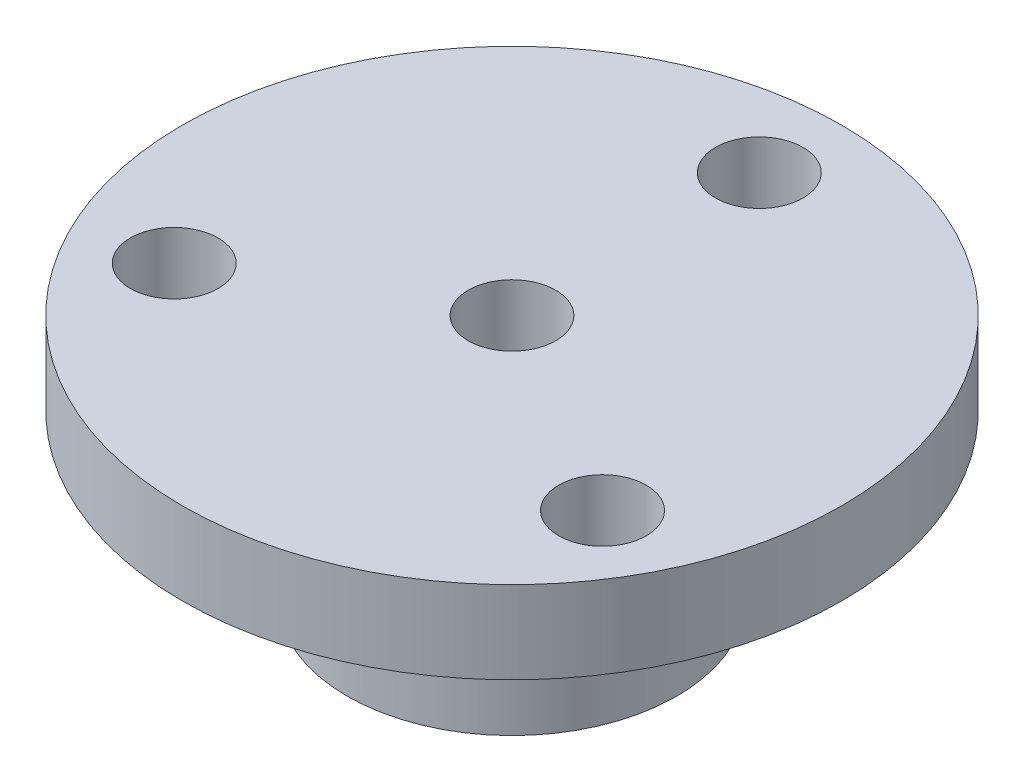
ISO-10303-21;
HEADER;
FILE_DESCRIPTION(('STEP AP214'),'2;1');
FILE_NAME('part.step','',(''),(''),'','','');
FILE_SCHEMA(('AUTOMOTIVE_DESIGN { 1 0 10303 214 1 1 1 1 }'));
ENDSEC;
DATA;
#1=APPLICATION_CONTEXT('core data for automotive mechanical design processes');
#2=APPLICATION_PROTOCOL_DEFINITION('international standard','automotive_design',2000,#1);
#3=PRODUCT_CONTEXT('',#1,'mechanical');
#4=PRODUCT('Part','Part','',(#3));
#5=PRODUCT_RELATED_PRODUCT_CATEGORY('part','',(#4));
#6=PRODUCT_DEFINITION_FORMATION('','',#4);
#7=PRODUCT_DEFINITION_CONTEXT('part definition',#1,'design');
#8=PRODUCT_DEFINITION('design','',#6,#7);
#9=PRODUCT_DEFINITION_SHAPE('','',#8);
#10=(LENGTH_UNIT() NAMED_UNIT(*) SI_UNIT(.MILLI.,.METRE.));
#11=(NAMED_UNIT(*) PLANE_ANGLE_UNIT() SI_UNIT($,.RADIAN.));
#12=(NAMED_UNIT(*) SI_UNIT($,.STERADIAN.) SOLID_ANGLE_UNIT());
#13=UNCERTAINTY_MEASURE_WITH_UNIT(LENGTH_MEASURE(1.E-05),#10,'distance_accuracy_value','');
#14=(GEOMETRIC_REPRESENTATION_CONTEXT(3) GLOBAL_UNCERTAINTY_ASSIGNED_CONTEXT((#13)) GLOBAL_UNIT_ASSIGNED_CONTEXT((#10,
#11,#12)) REPRESENTATION_CONTEXT('',''));
#15=CARTESIAN_POINT('',(0.,0.,0.));
#16=DIRECTION('',(0.,0.,1.));
#17=DIRECTION('',(1.,0.,0.));
#18=AXIS2_PLACEMENT_3D('',#15,#16,#17);
#19=CARTESIAN_POINT('',(0.,12.7,0.));
#20=DIRECTION('',(0.,-1.,0.));
#21=DIRECTION('',(0.,0.,-1.));
#22=AXIS2_PLACEMENT_3D('',#19,#20,#21);
#23=CYLINDRICAL_SURFACE('',#22,12.7);
#24=CARTESIAN_POINT('',(-2.45745,6.35,12.4599734950561));
#25=CARTESIAN_POINT('',(-2.4574448457959,6.48664242672499,12.4599761778988));
#26=CARTESIAN_POINT('',(-2.446014651362,6.6233507914143,12.4622456537329));
#27=CARTESIAN_POINT('',(-2.40063013384237,6.89290675159974,12.4710660856373));
#28=CARTESIAN_POINT('',(-2.36665721610313,7.0257510652777,12.4776205761908));
#29=CARTESIAN_POINT('',(-2.27727460436938,7.28363990049863,12.4942415344762));
#30=CARTESIAN_POINT('',(-2.22188551723814,7.40869178609644,12.5043046252844));
#31=CARTESIAN_POINT('',(-2.09129832369802,7.64772226148924,12.5268049218276));
#32=CARTESIAN_POINT('',(-2.01610155444819,7.76170159804916,12.5392419672883));
#33=CARTESIAN_POINT('',(-1.84697184812669,7.97686853830274,12.5652728543158));
#34=CARTESIAN_POINT('',(-1.75282701136112,8.07788815667578,12.5788786796091));
#35=CARTESIAN_POINT('',(-1.54893149930474,8.26280308915373,12.6056084254236));
#36=CARTESIAN_POINT('',(-1.43917976796169,8.34669724351488,12.6187323132584));
#37=CARTESIAN_POINT('',(-1.20607824513626,8.49562737626859,12.6431482698532));
#38=CARTESIAN_POINT('',(-1.08262508783677,8.56050437641428,12.6544245667306));
#39=CARTESIAN_POINT('',(-0.82631631226013,8.66853357239807,12.6737404425825));
#40=CARTESIAN_POINT('',(-0.693461518627308,8.71168767092656,12.6817803050213));
#41=CARTESIAN_POINT('',(-0.423862742022591,8.7745249727266,12.6936327851509));
#42=CARTESIAN_POINT('',(-0.287187096527185,8.79449159280585,12.6974964070093));
#43=CARTESIAN_POINT('',(-0.0123749641642468,8.81127079263568,12.7007370467831));
#44=CARTESIAN_POINT('',(0.125761389442495,8.80808546665416,12.7001144705089));
#45=CARTESIAN_POINT('',(0.397628285392874,8.77886742173493,12.69449256087));
#46=CARTESIAN_POINT('',(0.531393015116728,8.75313992652011,12.6895516998391));
#47=CARTESIAN_POINT('',(0.792670176599979,8.68005124588424,12.6759141280809));
#48=CARTESIAN_POINT('',(0.920182369552153,8.63268923487354,12.6672172740227));
#49=CARTESIAN_POINT('',(1.16621328724908,8.51738894916172,12.6469478098291));
#50=CARTESIAN_POINT('',(1.28467392907244,8.44932981288714,12.6353583816616));
#51=CARTESIAN_POINT('',(1.508606768977,8.29465645722117,12.6105835288909));
#52=CARTESIAN_POINT('',(1.61407756193908,8.20804023327068,12.5973979319346));
#53=CARTESIAN_POINT('',(1.81084660401586,8.01703300392843,12.5706353175682));
#54=CARTESIAN_POINT('',(1.90188539160334,7.91237492065857,12.5570554242244));
#55=CARTESIAN_POINT('',(2.06515946058258,7.68914143303397,12.5312397580398));
#56=CARTESIAN_POINT('',(2.13739443021129,7.57056579797665,12.5190040074865));
#57=CARTESIAN_POINT('',(2.26109165029383,7.32250562521867,12.4972571098091));
#58=CARTESIAN_POINT('',(2.31251416832229,7.1930007869265,12.4877511840622));
#59=CARTESIAN_POINT('',(2.39279595460755,6.92696352894975,12.4726185385136));
#60=CARTESIAN_POINT('',(2.42165795975938,6.79043196384462,12.4669913481788));
#61=CARTESIAN_POINT('',(2.45561638425017,6.51656219919693,12.460346956076));
#62=CARTESIAN_POINT('',(2.46108647558824,6.37927204189445,12.4592572777104));
#63=CARTESIAN_POINT('',(2.44910928480689,6.10574050548308,12.4616170579326));
#64=CARTESIAN_POINT('',(2.43166321414412,5.96949907131671,12.465066276573));
#65=CARTESIAN_POINT('',(2.37467036331905,5.70317383256491,12.4760475287435));
#66=CARTESIAN_POINT('',(2.33532125225701,5.57304608494399,12.483543027661));
#67=CARTESIAN_POINT('',(2.23584979748039,5.32123044657609,12.5017405459737));
#68=CARTESIAN_POINT('',(2.17572583680595,5.19954321366151,12.5124428149513));
#69=CARTESIAN_POINT('',(2.0355580499034,4.96642190363086,12.5360119939555));
#70=CARTESIAN_POINT('',(1.95527922707509,4.85513168879348,12.5489038148873));
#71=CARTESIAN_POINT('',(1.77739569825356,4.64746625446288,12.5753302611157));
#72=CARTESIAN_POINT('',(1.67978932831431,4.55109246904381,12.5888649480545));
#73=CARTESIAN_POINT('',(1.46834840823623,4.37458977357421,12.6152861078184));
#74=CARTESIAN_POINT('',(1.35430179847242,4.29471281074465,12.6281605468502));
#75=CARTESIAN_POINT('',(1.11419082006876,4.15525351851469,12.6516049623348));
#76=CARTESIAN_POINT('',(0.988126934855061,4.09567037318331,12.6621750314306));
#77=CARTESIAN_POINT('',(0.728240024572953,3.99886254115331,12.6797681683655));
#78=CARTESIAN_POINT('',(0.594463522735846,3.96151660338894,12.6868104379185));
#79=CARTESIAN_POINT('',(0.322387108479282,3.9098576157996,12.6966366275396));
#80=CARTESIAN_POINT('',(0.184087706221978,3.89554197734403,12.6994210261954));
#81=CARTESIAN_POINT('',(-0.0906971128940913,3.89044487497494,12.7004073808728));
#82=CARTESIAN_POINT('',(-0.227175364984209,3.89928371061225,12.698683270852));
#83=CARTESIAN_POINT('',(-0.496662826917979,3.93940985161233,12.6910008207745));
#84=CARTESIAN_POINT('',(-0.629672074771883,3.97069691090033,12.6850425271323));
#85=CARTESIAN_POINT('',(-0.888228202425111,4.05466718662815,12.6695621582855));
#86=CARTESIAN_POINT('',(-1.01378946448916,4.10730751800716,12.6600472290758));
#87=CARTESIAN_POINT('',(-1.25435295894836,4.23244341140539,12.6384809881019));
#88=CARTESIAN_POINT('',(-1.36935442229324,4.30494041801995,12.6264294918143));
#89=CARTESIAN_POINT('',(-1.58741907756561,4.46902637985321,12.6008869275532));
#90=CARTESIAN_POINT('',(-1.69027458438788,4.56088840368228,12.5873767865754));
#91=CARTESIAN_POINT('',(-1.8792417370891,4.76053271735398,12.5605565925732));
#92=CARTESIAN_POINT('',(-1.96534942772726,4.86831875733518,12.5472465874971));
#93=CARTESIAN_POINT('',(-2.11918691981705,5.09803774462214,12.5221882641966));
#94=CARTESIAN_POINT('',(-2.18672511647075,5.22010091392463,12.5104568224747));
#95=CARTESIAN_POINT('',(-2.30022710547816,5.47403223595291,12.4900883656506));
#96=CARTESIAN_POINT('',(-2.34621088906287,5.6058911712775,12.4814484849628));
#97=CARTESIAN_POINT('',(-2.40615510024334,5.84008101079934,12.4700067297984));
#98=CARTESIAN_POINT('',(-2.42535704026861,5.94105712398996,12.4662670679425));
#99=CARTESIAN_POINT('',(-2.45100623216742,6.14467644742993,12.4612494801056));
#100=CARTESIAN_POINT('',(-2.45745387314332,6.24731960672548,12.4599714790252));
#101=CARTESIAN_POINT('',(-2.45745,6.35,12.4599734950561));
#102=B_SPLINE_CURVE_WITH_KNOTS('',3,(#24,#25,#26,#27,#28,#29,#30,#31,#32,#33,#34,#35,#36,#37,
#38,#39,#40,#41,#42,#43,#44,#45,#46,#47,#48,#49,#50,#51,#52,#53,#54,#55,#56,#57,#58,#59,#60,#61,
#62,#63,#64,#65,#66,#67,#68,#69,#70,#71,#72,#73,#74,#75,#76,#77,#78,#79,#80,#81,#82,#83,#84,#85,
#86,#87,#88,#89,#90,#91,#92,#93,#94,#95,#96,#97,#98,#99,#100,#101),.UNSPECIFIED.,.T.,.F.,(4,2,2,
2,2,2,2,2,2,2,2,2,2,2,2,2,2,2,2,2,2,2,2,2,2,2,2,2,2,2,2,2,2,2,2,2,2,2,4),(0.,0.409551426062621,
0.819441096504625,1.22893734437489,1.63840595542539,2.05273728694917,2.46709666786626,
2.88482717007892,3.30252107726459,3.71505398101899,4.12754956852948,4.53454475553279,
4.94155547508066,5.35099013618775,5.76046904724236,6.1766323804962,6.59280261320481,
7.00976363837795,7.4266740726914,7.83689913161727,8.24710250497998,8.65366255669201,
9.0602542591468,9.47182672315997,9.88343873144225,10.3009354489507,10.7184153786502,
11.1335975926482,11.5487331364541,11.9571038258666,12.3654700388363,12.7730201342035,
13.1805998871754,13.5943656991633,14.0082291096411,14.4262149910528,14.8438124291629,
15.1515805615941,15.4593393046299),.UNSPECIFIED.);
#103=CARTESIAN_POINT('',(-2.45745,6.35,12.4599734950561));
#104=VERTEX_POINT('',#103);
#105=EDGE_CURVE('E79',#104,#104,#102,.T.);
#106=ORIENTED_EDGE('',*,*,#105,.T.);
#107=EDGE_LOOP('',(#106));
#108=FACE_BOUND('',#107,.T.);
#109=CARTESIAN_POINT('',(0.,12.7,0.));
#110=DIRECTION('',(0.,1.,0.));
#111=DIRECTION('',(0.,0.,1.));
#112=AXIS2_PLACEMENT_3D('',#109,#110,#111);
#113=CIRCLE('',#112,12.7);
#114=CARTESIAN_POINT('',(0.,12.7,12.7));
#115=VERTEX_POINT('',#114);
#116=EDGE_CURVE('E10',#115,#115,#113,.T.);
#117=ORIENTED_EDGE('',*,*,#116,.F.);
#118=EDGE_LOOP('',(#117));
#119=FACE_BOUND('',#118,.T.);
#120=CARTESIAN_POINT('',(0.,0.,0.));
#121=DIRECTION('',(0.,1.,0.));
#122=DIRECTION('',(0.,0.,1.));
#123=AXIS2_PLACEMENT_3D('',#120,#121,#122);
#124=CIRCLE('',#123,12.7);
#125=CARTESIAN_POINT('',(0.,0.,12.7));
#126=VERTEX_POINT('',#125);
#127=EDGE_CURVE('E43',#126,#126,#124,.T.);
#128=ORIENTED_EDGE('',*,*,#127,.T.);
#129=EDGE_LOOP('',(#128));
#130=FACE_BOUND('',#129,.T.);
#131=ADVANCED_FACE('F31',(#108,#119,#130),#23,.T.);
#132=CARTESIAN_POINT('',(0.,0.,0.));
#133=DIRECTION('',(0.,1.,0.));
#134=DIRECTION('',(0.,0.,1.));
#135=AXIS2_PLACEMENT_3D('',#132,#133,#134);
#136=PLANE('',#135);
#137=CARTESIAN_POINT('',(0.,0.,0.));
#138=DIRECTION('',(0.,1.,0.));
#139=DIRECTION('',(0.,0.,1.));
#140=AXIS2_PLACEMENT_3D('',#137,#138,#139);
#141=CIRCLE('',#140,3.3734375);
#142=CARTESIAN_POINT('',(0.,0.,3.3734375));
#143=VERTEX_POINT('',#142);
#144=EDGE_CURVE('E53',#143,#143,#141,.T.);
#145=ORIENTED_EDGE('',*,*,#144,.T.);
#146=EDGE_LOOP('',(#145));
#147=FACE_BOUND('',#146,.T.);
#148=ORIENTED_EDGE('',*,*,#127,.F.);
#149=EDGE_LOOP('',(#148));
#150=FACE_BOUND('',#149,.T.);
#151=ADVANCED_FACE('F113',(#147,#150),#136,.F.);
#152=CARTESIAN_POINT('',(0.,12.7,0.));
#153=DIRECTION('',(0.,1.,0.));
#154=DIRECTION('',(0.,0.,1.));
#155=AXIS2_PLACEMENT_3D('',#152,#153,#154);
#156=PLANE('',#155);
#157=CARTESIAN_POINT('',(0.,12.7,-19.05));
#158=DIRECTION('',(0.,1.,0.));
#159=DIRECTION('',(0.,0.,1.));
#160=AXIS2_PLACEMENT_3D('',#157,#158,#159);
#161=CIRCLE('',#160,3.3782);
#162=CARTESIAN_POINT('',(0.,12.7,-15.6718));
#163=VERTEX_POINT('',#162);
#164=EDGE_CURVE('E73',#163,#163,#161,.T.);
#165=ORIENTED_EDGE('',*,*,#164,.T.);
#166=EDGE_LOOP('',(#165));
#167=FACE_BOUND('',#166,.T.);
#168=CARTESIAN_POINT('',(-16.4977839420935,12.7,9.52500000000008));
#169=DIRECTION('',(0.,1.,0.));
#170=DIRECTION('',(0.,0.,1.));
#171=AXIS2_PLACEMENT_3D('',#168,#169,#170);
#172=CIRCLE('',#171,3.3782);
#173=CARTESIAN_POINT('',(-16.4977839420935,12.7,12.9032000000001));
#174=VERTEX_POINT('',#173);
#175=EDGE_CURVE('E67',#174,#174,#172,.T.);
#176=ORIENTED_EDGE('',*,*,#175,.T.);
#177=EDGE_LOOP('',(#176));
#178=FACE_BOUND('',#177,.T.);
#179=CARTESIAN_POINT('',(16.4977839420935,12.7,9.52500000000008));
#180=DIRECTION('',(0.,1.,0.));
#181=DIRECTION('',(0.,0.,1.));
#182=AXIS2_PLACEMENT_3D('',#179,#180,#181);
#183=CIRCLE('',#182,3.3782);
#184=CARTESIAN_POINT('',(16.4977839420935,12.7,12.9032000000001));
#185=VERTEX_POINT('',#184);
#186=EDGE_CURVE('E59',#185,#185,#183,.T.);
#187=ORIENTED_EDGE('',*,*,#186,.T.);
#188=EDGE_LOOP('',(#187));
#189=FACE_BOUND('',#188,.T.);
#190=CARTESIAN_POINT('',(0.,12.7,0.));
#191=DIRECTION('',(0.,1.,0.));
#192=DIRECTION('',(0.,0.,1.));
#193=AXIS2_PLACEMENT_3D('',#190,#191,#192);
#194=CIRCLE('',#193,25.4);
#195=CARTESIAN_POINT('',(0.,12.7,25.4));
#196=VERTEX_POINT('',#195);
#197=EDGE_CURVE('E50',#196,#196,#194,.T.);
#198=ORIENTED_EDGE('',*,*,#197,.F.);
#199=EDGE_LOOP('',(#198));
#200=FACE_BOUND('',#199,.T.);
#201=ORIENTED_EDGE('',*,*,#116,.T.);
#202=EDGE_LOOP('',(#201));
#203=FACE_BOUND('',#202,.T.);
#204=ADVANCED_FACE('F110',(#167,#178,#189,#200,#203),#156,.F.);
#205=CARTESIAN_POINT('',(0.,19.05,0.));
#206=DIRECTION('',(0.,-1.,0.));
#207=DIRECTION('',(0.,0.,-1.));
#208=AXIS2_PLACEMENT_3D('',#205,#206,#207);
#209=CYLINDRICAL_SURFACE('',#208,25.4);
#210=CARTESIAN_POINT('',(0.,19.05,0.));
#211=DIRECTION('',(0.,1.,0.));
#212=DIRECTION('',(0.,0.,1.));
#213=AXIS2_PLACEMENT_3D('',#210,#211,#212);
#214=CIRCLE('',#213,25.4);
#215=CARTESIAN_POINT('',(0.,19.05,25.4));
#216=VERTEX_POINT('',#215);
#217=EDGE_CURVE('E48',#216,#216,#214,.T.);
#218=ORIENTED_EDGE('',*,*,#217,.F.);
#219=EDGE_LOOP('',(#218));
#220=FACE_BOUND('',#219,.T.);
#221=ORIENTED_EDGE('',*,*,#197,.T.);
#222=EDGE_LOOP('',(#221));
#223=FACE_BOUND('',#222,.T.);
#224=ADVANCED_FACE('F108',(#220,#223),#209,.T.);
#225=CARTESIAN_POINT('',(0.,19.05,0.));
#226=DIRECTION('',(0.,1.,0.));
#227=DIRECTION('',(0.,0.,1.));
#228=AXIS2_PLACEMENT_3D('',#225,#226,#227);
#229=PLANE('',#228);
#230=CARTESIAN_POINT('',(0.,19.05,-19.05));
#231=DIRECTION('',(0.,1.,0.));
#232=DIRECTION('',(0.,0.,1.));
#233=AXIS2_PLACEMENT_3D('',#230,#231,#232);
#234=CIRCLE('',#233,3.3782);
#235=CARTESIAN_POINT('',(0.,19.05,-15.6718));
#236=VERTEX_POINT('',#235);
#237=EDGE_CURVE('E76',#236,#236,#234,.T.);
#238=ORIENTED_EDGE('',*,*,#237,.F.);
#239=EDGE_LOOP('',(#238));
#240=FACE_BOUND('',#239,.T.);
#241=CARTESIAN_POINT('',(-16.4977839420935,19.05,9.52500000000008));
#242=DIRECTION('',(0.,1.,0.));
#243=DIRECTION('',(0.,0.,1.));
#244=AXIS2_PLACEMENT_3D('',#241,#242,#243);
#245=CIRCLE('',#244,3.3782);
#246=CARTESIAN_POINT('',(-16.4977839420935,19.05,12.9032000000001));
#247=VERTEX_POINT('',#246);
#248=EDGE_CURVE('E70',#247,#247,#245,.T.);
#249=ORIENTED_EDGE('',*,*,#248,.F.);
#250=EDGE_LOOP('',(#249));
#251=FACE_BOUND('',#250,.T.);
#252=CARTESIAN_POINT('',(16.4977839420935,19.05,9.52500000000008));
#253=DIRECTION('',(0.,1.,0.));
#254=DIRECTION('',(0.,0.,1.));
#255=AXIS2_PLACEMENT_3D('',#252,#253,#254);
#256=CIRCLE('',#255,3.3782);
#257=CARTESIAN_POINT('',(16.4977839420935,19.05,12.9032000000001));
#258=VERTEX_POINT('',#257);
#259=EDGE_CURVE('E64',#258,#258,#256,.T.);
#260=ORIENTED_EDGE('',*,*,#259,.F.);
#261=EDGE_LOOP('',(#260));
#262=FACE_BOUND('',#261,.T.);
#263=CARTESIAN_POINT('',(0.,19.05,0.));
#264=DIRECTION('',(0.,1.,0.));
#265=DIRECTION('',(0.,0.,1.));
#266=AXIS2_PLACEMENT_3D('',#263,#264,#265);
#267=CIRCLE('',#266,3.3734375);
#268=CARTESIAN_POINT('',(0.,19.05,3.3734375));
#269=VERTEX_POINT('',#268);
#270=EDGE_CURVE('E56',#269,#269,#267,.T.);
#271=ORIENTED_EDGE('',*,*,#270,.F.);
#272=EDGE_LOOP('',(#271));
#273=FACE_BOUND('',#272,.T.);
#274=ORIENTED_EDGE('',*,*,#217,.T.);
#275=EDGE_LOOP('',(#274));
#276=FACE_BOUND('',#275,.T.);
#277=ADVANCED_FACE('F104',(#240,#251,#262,#273,#276),#229,.T.);
#278=CARTESIAN_POINT('',(0.,0.,0.));
#279=DIRECTION('',(0.,1.,0.));
#280=DIRECTION('',(0.,0.,1.));
#281=AXIS2_PLACEMENT_3D('',#278,#279,#280);
#282=CYLINDRICAL_SURFACE('',#281,3.3734375);
#283=CARTESIAN_POINT('',(0.,3.89255,3.3734375));
#284=CARTESIAN_POINT('',(0.120809819258964,3.89255742435154,3.37343042836875));
#285=CARTESIAN_POINT('',(0.241823751778381,3.90153039226537,3.36687840714502));
#286=CARTESIAN_POINT('',(0.480076168684002,3.93687492647653,3.34126463938644));
#287=CARTESIAN_POINT('',(0.59730409438668,3.96329137076398,3.32217062590315));
#288=CARTESIAN_POINT('',(0.823900726131385,4.03177299389469,3.27332022419693));
#289=CARTESIAN_POINT('',(0.933311705404955,4.07374496374914,3.243627382656));
#290=CARTESIAN_POINT('',(1.14286956932636,4.17140225381821,3.17585807719619));
#291=CARTESIAN_POINT('',(1.2430193961436,4.22708319810663,3.13778428889871));
#292=CARTESIAN_POINT('',(1.44160894933497,4.35598587734537,3.05197992264272));
#293=CARTESIAN_POINT('',(1.53906314289097,4.43034294312858,3.00368578752956));
#294=CARTESIAN_POINT('',(1.72097540486943,4.59156098084748,2.90329914556908));
#295=CARTESIAN_POINT('',(1.8054125372389,4.67844166983441,2.85120071432524));
#296=CARTESIAN_POINT('',(1.97552827081189,4.88129143958565,2.7367434454912));
#297=CARTESIAN_POINT('',(2.05834425481899,4.99964431632546,2.67433150998881));
#298=CARTESIAN_POINT('',(2.20310389845215,5.2516209472937,2.55638373579672));
#299=CARTESIAN_POINT('',(2.26507931146999,5.38522105047451,2.50083751869401));
#300=CARTESIAN_POINT('',(2.34867743786964,5.62009874895566,2.42197241020342));
#301=CARTESIAN_POINT('',(2.37686726595916,5.71747859341286,2.39406868833275));
#302=CARTESIAN_POINT('',(2.42120825745763,5.91729211522708,2.3492206216884));
#303=CARTESIAN_POINT('',(2.43738610972717,6.01971404618924,2.33225199188832));
#304=CARTESIAN_POINT('',(2.45665652740064,6.22797089407639,2.31195615411444));
#305=CARTESIAN_POINT('',(2.45965193410343,6.33382537879628,2.30873023975054));
#306=CARTESIAN_POINT('',(2.45201170727871,6.54450664502808,2.31683810619761));
#307=CARTESIAN_POINT('',(2.44136617778752,6.64933262478575,2.32818245717799));
#308=CARTESIAN_POINT('',(2.40539238388608,6.86633789586512,2.36535099034132));
#309=CARTESIAN_POINT('',(2.37852799253085,6.97799227580827,2.39267906751035));
#310=CARTESIAN_POINT('',(2.31085757692996,7.19370920327882,2.45809253832808));
#311=CARTESIAN_POINT('',(2.27001920124956,7.29775344788235,2.49620285837556));
#312=CARTESIAN_POINT('',(2.15997991117618,7.53127489883722,2.59259499255298));
#313=CARTESIAN_POINT('',(2.08585712860835,7.65740651728297,2.65333394740023));
#314=CARTESIAN_POINT('',(1.91741996088834,7.89391152611339,2.77751266262892));
#315=CARTESIAN_POINT('',(1.82308338987352,8.0042673779536,2.8409553287061));
#316=CARTESIAN_POINT('',(1.61386339061077,8.20908457492367,2.96487982935868));
#317=CARTESIAN_POINT('',(1.49873189377957,8.30332384756018,3.02531323803714));
#318=CARTESIAN_POINT('',(1.2501010043613,8.47100556712444,3.13619959331142));
#319=CARTESIAN_POINT('',(1.11664480211936,8.54449570929199,3.18667534730893));
#320=CARTESIAN_POINT('',(0.870452633779477,8.65097219295202,3.26105100028312));
#321=CARTESIAN_POINT('',(0.761168274310344,8.68951184626901,3.2884464876608));
#322=CARTESIAN_POINT('',(0.536229381377058,8.75105788526638,3.33251127123385));
#323=CARTESIAN_POINT('',(0.420579614120613,8.77407572653578,3.34918847743271));
#324=CARTESIAN_POINT('',(0.185609145455707,8.80329829541414,3.3703991287777));
#325=CARTESIAN_POINT('',(0.0662764871670874,8.80944075460467,3.37488759804019));
#326=CARTESIAN_POINT('',(-0.171819100272039,8.80432590313485,3.37116184013932));
#327=CARTESIAN_POINT('',(-0.290582008334039,8.79306795333159,3.36294714636988));
#328=CARTESIAN_POINT('',(-0.517113239967224,8.75501555990001,3.33541032803371));
#329=CARTESIAN_POINT('',(-0.62512205300109,8.72914551505946,3.31674962163702));
#330=CARTESIAN_POINT('',(-0.834862473708972,8.66390117087595,3.27026544229479));
#331=CARTESIAN_POINT('',(-0.936592770366474,8.62452406230548,3.24244006330935));
#332=CARTESIAN_POINT('',(-1.14018387268981,8.53006026017112,3.17685848727746));
#333=CARTESIAN_POINT('',(-1.24135881494024,8.47394320348737,3.1384710324186));
#334=CARTESIAN_POINT('',(-1.43318370686475,8.34953401038299,3.05565074471029));
#335=CARTESIAN_POINT('',(-1.52382666644383,8.28123386339009,3.01121393889836));
#336=CARTESIAN_POINT('',(-1.7095035808293,8.12042051083891,2.91045871988082));
#337=CARTESIAN_POINT('',(-1.80230789273614,8.02576355563223,2.85345375959012));
#338=CARTESIAN_POINT('',(-1.9716252860586,7.82283460895605,2.73919772419974));
#339=CARTESIAN_POINT('',(-2.04812484666876,7.71455143528688,2.68194648469375));
#340=CARTESIAN_POINT('',(-2.17575826039905,7.49847364398689,2.57915956803625));
#341=CARTESIAN_POINT('',(-2.22881053952334,7.39209699577444,2.53303640218665));
#342=CARTESIAN_POINT('',(-2.31979398625661,7.16974056881281,2.44998668603787));
#343=CARTESIAN_POINT('',(-2.35775672118173,7.05378145742609,2.41304099788241));
#344=CARTESIAN_POINT('',(-2.4100312007196,6.84002409031786,2.36069901009099));
#345=CARTESIAN_POINT('',(-2.42769660056338,6.7437862102143,2.34235931003165));
#346=CARTESIAN_POINT('',(-2.45139331594573,6.54843307641532,2.3175552602526));
#347=CARTESIAN_POINT('',(-2.45744161335363,6.44932223803325,2.31107357715495));
#348=CARTESIAN_POINT('',(-2.45745838239333,6.25093577656586,2.31105583450143));
#349=CARTESIAN_POINT('',(-2.45140712717078,6.15166014847978,2.31754091568308));
#350=CARTESIAN_POINT('',(-2.4276654549533,5.95597776084592,2.34239180376532));
#351=CARTESIAN_POINT('',(-2.40995666748357,5.85957578076592,2.36077636163998));
#352=CARTESIAN_POINT('',(-2.35703276927338,5.64338303591173,2.41376237084077));
#353=CARTESIAN_POINT('',(-2.31815018099888,5.52529908096957,2.45158133370512));
#354=CARTESIAN_POINT('',(-2.22480999245752,5.29913298315097,2.5365881798439));
#355=CARTESIAN_POINT('',(-2.17032609061252,5.19106814179411,2.5837918429474));
#356=CARTESIAN_POINT('',(-2.04544902866081,4.98237419994712,2.68380417276703));
#357=CARTESIAN_POINT('',(-1.97463350005943,4.88205899792132,2.73673721023781));
#358=CARTESIAN_POINT('',(-1.8189352559868,4.6930285037471,2.84261386197605));
#359=CARTESIAN_POINT('',(-1.73404664892339,4.60431809780778,2.89555747135838));
#360=CARTESIAN_POINT('',(-1.53020026351651,4.42122159307609,3.00914666991995));
#361=CARTESIAN_POINT('',(-1.40786162580257,4.32993668420893,3.06889789258127));
#362=CARTESIAN_POINT('',(-1.21059162452045,4.210033249415,3.14954348735062));
#363=CARTESIAN_POINT('',(-1.14253508451073,4.17290039203407,3.17493020740931));
#364=CARTESIAN_POINT('',(-1.00218518355411,4.10483582270997,3.22198289550099));
#365=CARTESIAN_POINT('',(-0.929894049087881,4.07390088915728,3.2436507956896));
#366=CARTESIAN_POINT('',(-0.749692614693299,4.00696740173168,3.29090231203451));
#367=CARTESIAN_POINT('',(-0.639820997689785,3.97450185755068,3.31416978450867));
#368=CARTESIAN_POINT('',(-0.415140670052222,3.92515459099675,3.34971635600582));
#369=CARTESIAN_POINT('',(-0.300347822973564,3.90822623496866,3.36202833367388));
#370=CARTESIAN_POINT('',(-0.154058810248004,3.89718894646974,3.37005963799728));
#371=CARTESIAN_POINT('',(-0.123292125837088,3.89545138156316,3.37132440222078));
#372=CARTESIAN_POINT('',(-0.0616880716105748,3.89313086622181,3.37301430460906));
#373=CARTESIAN_POINT('',(-0.0308506910886242,3.89254810407485,3.37343930585248));
#374=CARTESIAN_POINT('',(0.,3.89255,3.3734375));
#375=B_SPLINE_CURVE_WITH_KNOTS('',3,(#283,#284,#285,#286,#287,#288,#289,#290,#291,#292,#293,
#294,#295,#296,#297,#298,#299,#300,#301,#302,#303,#304,#305,#306,#307,#308,#309,#310,#311,#312,
#313,#314,#315,#316,#317,#318,#319,#320,#321,#322,#323,#324,#325,#326,#327,#328,#329,#330,#331,
#332,#333,#334,#335,#336,#337,#338,#339,#340,#341,#342,#343,#344,#345,#346,#347,#348,#349,#350,
#351,#352,#353,#354,#355,#356,#357,#358,#359,#360,#361,#362,#363,#364,#365,#366,#367,#368,#369,
#370,#371,#372,#373,#374),.UNSPECIFIED.,.T.,.F.,(4,2,2,2,2,2,2,2,2,2,2,2,2,2,2,2,2,2,2,2,2,2,2,
2,2,2,2,2,2,2,2,2,2,2,2,2,2,2,2,2,2,2,2,2,2,4),(0.,0.362294815515208,0.725525381688672,
1.08661375464555,1.44758701671936,1.84141921782735,2.23587837693966,2.70592539578187,
3.17525295545699,3.48957539143992,3.80319734158847,4.11912695238352,4.43528588752125,
4.78750356742649,5.140542252921,5.61334313295488,6.08666562339284,6.56606034639864,
7.04434396059499,7.40008856129506,7.75557032301653,8.11236202519496,8.46916683317458,
8.80558622054163,9.142075619587,9.50641069410823,9.87098621364781,10.302249318479,
10.7338686710483,11.1151130425766,11.4955555996616,11.7929607692989,12.089930860479,
12.3873855201954,12.6853100483432,13.0730191158299,13.4613856927123,13.8612231582274,
14.2612284374631,14.7499065157095,14.9942859868412,15.2385381008903,15.5877108012319,
15.9358320267533,16.0283346359081,16.1208523261507),.UNSPECIFIED.);
#376=CARTESIAN_POINT('',(0.,3.89255,3.3734375));
#377=VERTEX_POINT('',#376);
#378=EDGE_CURVE('E35',#377,#377,#375,.T.);
#379=ORIENTED_EDGE('',*,*,#378,.T.);
#380=EDGE_LOOP('',(#379));
#381=FACE_BOUND('',#380,.T.);
#382=ORIENTED_EDGE('',*,*,#144,.F.);
#383=EDGE_LOOP('',(#382));
#384=FACE_BOUND('',#383,.T.);
#385=ORIENTED_EDGE('',*,*,#270,.T.);
#386=EDGE_LOOP('',(#385));
#387=FACE_BOUND('',#386,.T.);
#388=ADVANCED_FACE('F99',(#381,#384,#387),#282,.F.);
#389=CARTESIAN_POINT('',(16.4977839420935,19.05,9.52500000000008));
#390=DIRECTION('',(0.,1.,0.));
#391=DIRECTION('',(0.,0.,1.));
#392=AXIS2_PLACEMENT_3D('',#389,#390,#391);
#393=CYLINDRICAL_SURFACE('',#392,3.3782);
#394=ORIENTED_EDGE('',*,*,#259,.T.);
#395=EDGE_LOOP('',(#394));
#396=FACE_BOUND('',#395,.T.);
#397=ORIENTED_EDGE('',*,*,#186,.F.);
#398=EDGE_LOOP('',(#397));
#399=FACE_BOUND('',#398,.T.);
#400=ADVANCED_FACE('F96',(#396,#399),#393,.F.);
#401=CARTESIAN_POINT('',(-16.4977839420935,19.05,9.52500000000008));
#402=DIRECTION('',(0.,1.,0.));
#403=DIRECTION('',(0.,0.,1.));
#404=AXIS2_PLACEMENT_3D('',#401,#402,#403);
#405=CYLINDRICAL_SURFACE('',#404,3.3782);
#406=ORIENTED_EDGE('',*,*,#248,.T.);
#407=EDGE_LOOP('',(#406));
#408=FACE_BOUND('',#407,.T.);
#409=ORIENTED_EDGE('',*,*,#175,.F.);
#410=EDGE_LOOP('',(#409));
#411=FACE_BOUND('',#410,.T.);
#412=ADVANCED_FACE('F92',(#408,#411),#405,.F.);
#413=CARTESIAN_POINT('',(0.,19.05,-19.05));
#414=DIRECTION('',(0.,1.,0.));
#415=DIRECTION('',(0.,0.,1.));
#416=AXIS2_PLACEMENT_3D('',#413,#414,#415);
#417=CYLINDRICAL_SURFACE('',#416,3.3782);
#418=ORIENTED_EDGE('',*,*,#237,.T.);
#419=EDGE_LOOP('',(#418));
#420=FACE_BOUND('',#419,.T.);
#421=ORIENTED_EDGE('',*,*,#164,.F.);
#422=EDGE_LOOP('',(#421));
#423=FACE_BOUND('',#422,.T.);
#424=ADVANCED_FACE('F87',(#420,#423),#417,.F.);
#425=CARTESIAN_POINT('',(0.,6.35,0.));
#426=DIRECTION('',(0.,0.,-1.));
#427=DIRECTION('',(-1.,0.,0.));
#428=AXIS2_PLACEMENT_3D('',#425,#426,#427);
#429=CYLINDRICAL_SURFACE('',#428,2.45745);
#430=ORIENTED_EDGE('',*,*,#378,.F.);
#431=EDGE_LOOP('',(#430));
#432=FACE_BOUND('',#431,.T.);
#433=ORIENTED_EDGE('',*,*,#105,.F.);
#434=EDGE_LOOP('',(#433));
#435=FACE_BOUND('',#434,.T.);
#436=ADVANCED_FACE('F83',(#432,#435),#429,.F.);
#437=CLOSED_SHELL('',(#131,#151,#204,#224,#277,#388,#400,#412,#424,#436));
#438=MANIFOLD_SOLID_BREP('B2',#437);
#439=ADVANCED_BREP_SHAPE_REPRESENTATION('',(#18,#438),#14);
#440=SHAPE_DEFINITION_REPRESENTATION(#9,#439);
ENDSEC;
END-ISO-10303-21;
